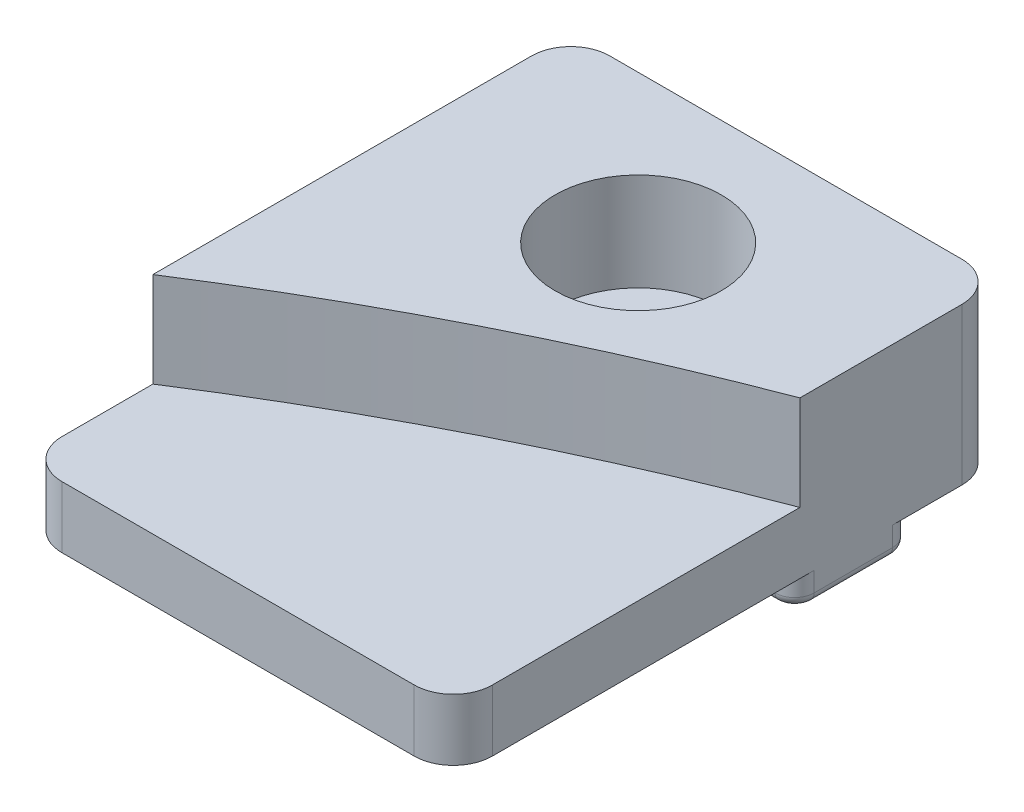
ISO-10303-21;
HEADER;
FILE_DESCRIPTION(('STEP AP214'),'2;1');
FILE_NAME('part.step','',(''),(''),'','','');
FILE_SCHEMA(('AUTOMOTIVE_DESIGN { 1 0 10303 214 1 1 1 1 }'));
ENDSEC;
DATA;
#1=APPLICATION_CONTEXT('core data for automotive mechanical design processes');
#2=APPLICATION_PROTOCOL_DEFINITION('international standard','automotive_design',2000,#1);
#3=PRODUCT_CONTEXT('',#1,'mechanical');
#4=PRODUCT('Part','Part','',(#3));
#5=PRODUCT_RELATED_PRODUCT_CATEGORY('part','',(#4));
#6=PRODUCT_DEFINITION_FORMATION('','',#4);
#7=PRODUCT_DEFINITION_CONTEXT('part definition',#1,'design');
#8=PRODUCT_DEFINITION('design','',#6,#7);
#9=PRODUCT_DEFINITION_SHAPE('','',#8);
#10=(LENGTH_UNIT() NAMED_UNIT(*) SI_UNIT(.MILLI.,.METRE.));
#11=(NAMED_UNIT(*) PLANE_ANGLE_UNIT() SI_UNIT($,.RADIAN.));
#12=(NAMED_UNIT(*) SI_UNIT($,.STERADIAN.) SOLID_ANGLE_UNIT());
#13=UNCERTAINTY_MEASURE_WITH_UNIT(LENGTH_MEASURE(1.E-05),#10,'distance_accuracy_value','');
#14=(GEOMETRIC_REPRESENTATION_CONTEXT(3) GLOBAL_UNCERTAINTY_ASSIGNED_CONTEXT((#13)) GLOBAL_UNIT_ASSIGNED_CONTEXT((#10,
#11,#12)) REPRESENTATION_CONTEXT('',''));
#15=CARTESIAN_POINT('',(0.,0.,0.));
#16=DIRECTION('',(0.,0.,1.));
#17=DIRECTION('',(1.,0.,0.));
#18=AXIS2_PLACEMENT_3D('',#15,#16,#17);
#19=CARTESIAN_POINT('',(-11.,-1.5,14.));
#20=DIRECTION('',(0.,0.,1.));
#21=DIRECTION('',(1.,0.,0.));
#22=AXIS2_PLACEMENT_3D('',#19,#20,#21);
#23=PLANE('',#22);
#24=DIRECTION('',(1.,0.,0.));
#25=VECTOR('',#24,1.);
#26=CARTESIAN_POINT('',(-11.,3.15,14.));
#27=LINE('',#26,#25);
#28=CARTESIAN_POINT('',(-9.,3.15,14.));
#29=VERTEX_POINT('',#28);
#30=CARTESIAN_POINT('',(9.,3.15,14.));
#31=VERTEX_POINT('',#30);
#32=EDGE_CURVE('E214',#29,#31,#27,.T.);
#33=ORIENTED_EDGE('',*,*,#32,.F.);
#34=DIRECTION('',(0.,1.,0.));
#35=VECTOR('',#34,1.);
#36=CARTESIAN_POINT('',(-9.,-1.5,14.));
#37=LINE('',#36,#35);
#38=CARTESIAN_POINT('',(-9.,0.,14.));
#39=VERTEX_POINT('',#38);
#40=EDGE_CURVE('E339',#29,#39,#37,.F.);
#41=ORIENTED_EDGE('',*,*,#40,.T.);
#42=DIRECTION('',(1.,0.,0.));
#43=VECTOR('',#42,1.);
#44=CARTESIAN_POINT('',(-11.,0.,14.));
#45=LINE('',#44,#43);
#46=CARTESIAN_POINT('',(9.,0.,14.));
#47=VERTEX_POINT('',#46);
#48=EDGE_CURVE('E230',#39,#47,#45,.T.);
#49=ORIENTED_EDGE('',*,*,#48,.T.);
#50=DIRECTION('',(0.,1.,0.));
#51=VECTOR('',#50,1.);
#52=CARTESIAN_POINT('',(9.,-1.5,14.));
#53=LINE('',#52,#51);
#54=EDGE_CURVE('E336',#47,#31,#53,.T.);
#55=ORIENTED_EDGE('',*,*,#54,.T.);
#56=EDGE_LOOP('',(#33,#41,#49,#55));
#57=FACE_BOUND('',#56,.T.);
#58=ADVANCED_FACE('F39',(#57),#23,.T.);
#59=CARTESIAN_POINT('',(-11.,-1.5,-14.));
#60=DIRECTION('',(-1.,0.,0.));
#61=DIRECTION('',(0.,0.,1.));
#62=AXIS2_PLACEMENT_3D('',#59,#60,#61);
#63=PLANE('',#62);
#64=DIRECTION('',(0.,0.,1.));
#65=VECTOR('',#64,1.);
#66=CARTESIAN_POINT('',(-11.,0.,-3.45));
#67=LINE('',#66,#65);
#68=CARTESIAN_POINT('',(-11.,0.,-4.45));
#69=VERTEX_POINT('',#68);
#70=CARTESIAN_POINT('',(-11.,0.,12.));
#71=VERTEX_POINT('',#70);
#72=EDGE_CURVE('E225',#69,#71,#67,.T.);
#73=ORIENTED_EDGE('',*,*,#72,.T.);
#74=DIRECTION('',(0.,1.,0.));
#75=VECTOR('',#74,1.);
#76=CARTESIAN_POINT('',(-11.,-1.5,12.));
#77=LINE('',#76,#75);
#78=CARTESIAN_POINT('',(-11.,3.15,12.));
#79=VERTEX_POINT('',#78);
#80=EDGE_CURVE('E213',#71,#79,#77,.T.);
#81=ORIENTED_EDGE('',*,*,#80,.T.);
#82=DIRECTION('',(0.,0.,1.));
#83=VECTOR('',#82,1.);
#84=CARTESIAN_POINT('',(-11.,3.15,7.35859212357451));
#85=LINE('',#84,#83);
#86=CARTESIAN_POINT('',(-11.,3.15,7.35859212357451));
#87=VERTEX_POINT('',#86);
#88=EDGE_CURVE('E206',#87,#79,#85,.T.);
#89=ORIENTED_EDGE('',*,*,#88,.F.);
#90=DIRECTION('',(0.,1.,0.));
#91=VECTOR('',#90,1.);
#92=CARTESIAN_POINT('',(-11.,3.15,7.35859212357451));
#93=LINE('',#92,#91);
#94=CARTESIAN_POINT('',(-11.,8.,7.35859212357451));
#95=VERTEX_POINT('',#94);
#96=EDGE_CURVE('E190',#87,#95,#93,.T.);
#97=ORIENTED_EDGE('',*,*,#96,.T.);
#98=DIRECTION('',(0.,0.,1.));
#99=VECTOR('',#98,1.);
#100=CARTESIAN_POINT('',(-11.,8.,-14.));
#101=LINE('',#100,#99);
#102=CARTESIAN_POINT('',(-11.,8.,-12.));
#103=VERTEX_POINT('',#102);
#104=EDGE_CURVE('E239',#103,#95,#101,.T.);
#105=ORIENTED_EDGE('',*,*,#104,.F.);
#106=DIRECTION('',(0.,1.,0.));
#107=VECTOR('',#106,1.);
#108=CARTESIAN_POINT('',(-11.,-1.5,-12.));
#109=LINE('',#108,#107);
#110=CARTESIAN_POINT('',(-11.,0.,-12.));
#111=VERTEX_POINT('',#110);
#112=EDGE_CURVE('E306',#103,#111,#109,.F.);
#113=ORIENTED_EDGE('',*,*,#112,.T.);
#114=DIRECTION('',(0.,0.,1.));
#115=VECTOR('',#114,1.);
#116=CARTESIAN_POINT('',(-11.,0.,-14.));
#117=LINE('',#116,#115);
#118=CARTESIAN_POINT('',(-11.,0.,-8.45));
#119=VERTEX_POINT('',#118);
#120=EDGE_CURVE('E372',#111,#119,#117,.T.);
#121=ORIENTED_EDGE('',*,*,#120,.T.);
#122=DIRECTION('',(0.,-1.,0.));
#123=VECTOR('',#122,1.);
#124=CARTESIAN_POINT('',(-11.,-1.5,-8.45));
#125=LINE('',#124,#123);
#126=CARTESIAN_POINT('',(-11.,-1.,-8.45));
#127=VERTEX_POINT('',#126);
#128=EDGE_CURVE('E252',#119,#127,#125,.T.);
#129=ORIENTED_EDGE('',*,*,#128,.T.);
#130=DIRECTION('',(0.,0.,1.));
#131=VECTOR('',#130,1.);
#132=CARTESIAN_POINT('',(-11.,-1.,-4.45));
#133=LINE('',#132,#131);
#134=CARTESIAN_POINT('',(-11.,-1.,-4.45));
#135=VERTEX_POINT('',#134);
#136=EDGE_CURVE('E302',#127,#135,#133,.T.);
#137=ORIENTED_EDGE('',*,*,#136,.T.);
#138=DIRECTION('',(0.,1.,0.));
#139=VECTOR('',#138,1.);
#140=CARTESIAN_POINT('',(-11.,0.,-4.45));
#141=LINE('',#140,#139);
#142=EDGE_CURVE('E255',#135,#69,#141,.T.);
#143=ORIENTED_EDGE('',*,*,#142,.T.);
#144=EDGE_LOOP('',(#73,#81,#89,#97,#105,#113,#121,#129,#137,#143));
#145=FACE_BOUND('',#144,.T.);
#146=ADVANCED_FACE('F211',(#145),#63,.T.);
#147=CARTESIAN_POINT('',(11.,-1.5,-14.));
#148=DIRECTION('',(0.,0.,-1.));
#149=DIRECTION('',(-1.,0.,0.));
#150=AXIS2_PLACEMENT_3D('',#147,#148,#149);
#151=PLANE('',#150);
#152=DIRECTION('',(1.,0.,0.));
#153=VECTOR('',#152,1.);
#154=CARTESIAN_POINT('',(-11.,0.,-14.));
#155=LINE('',#154,#153);
#156=CARTESIAN_POINT('',(-9.,0.,-14.));
#157=VERTEX_POINT('',#156);
#158=CARTESIAN_POINT('',(9.,0.,-14.));
#159=VERTEX_POINT('',#158);
#160=EDGE_CURVE('E363',#157,#159,#155,.T.);
#161=ORIENTED_EDGE('',*,*,#160,.F.);
#162=DIRECTION('',(0.,1.,0.));
#163=VECTOR('',#162,1.);
#164=CARTESIAN_POINT('',(-9.,-1.5,-14.));
#165=LINE('',#164,#163);
#166=CARTESIAN_POINT('',(-9.,8.,-14.));
#167=VERTEX_POINT('',#166);
#168=EDGE_CURVE('E352',#157,#167,#165,.T.);
#169=ORIENTED_EDGE('',*,*,#168,.T.);
#170=DIRECTION('',(-1.,0.,0.));
#171=VECTOR('',#170,1.);
#172=CARTESIAN_POINT('',(11.,8.,-14.));
#173=LINE('',#172,#171);
#174=CARTESIAN_POINT('',(9.,8.,-14.));
#175=VERTEX_POINT('',#174);
#176=EDGE_CURVE('E237',#175,#167,#173,.T.);
#177=ORIENTED_EDGE('',*,*,#176,.F.);
#178=DIRECTION('',(0.,1.,0.));
#179=VECTOR('',#178,1.);
#180=CARTESIAN_POINT('',(9.,-1.5,-14.));
#181=LINE('',#180,#179);
#182=EDGE_CURVE('E350',#175,#159,#181,.F.);
#183=ORIENTED_EDGE('',*,*,#182,.T.);
#184=EDGE_LOOP('',(#161,#169,#177,#183));
#185=FACE_BOUND('',#184,.T.);
#186=ADVANCED_FACE('F376',(#185),#151,.T.);
#187=CARTESIAN_POINT('',(11.,-1.5,14.));
#188=DIRECTION('',(1.,0.,0.));
#189=DIRECTION('',(0.,0.,-1.));
#190=AXIS2_PLACEMENT_3D('',#187,#188,#189);
#191=PLANE('',#190);
#192=DIRECTION('',(0.,0.,-1.));
#193=VECTOR('',#192,1.);
#194=CARTESIAN_POINT('',(11.,3.15,14.));
#195=LINE('',#194,#193);
#196=CARTESIAN_POINT('',(11.,3.15,12.));
#197=VERTEX_POINT('',#196);
#198=CARTESIAN_POINT('',(11.,3.15,-3.71881430774099));
#199=VERTEX_POINT('',#198);
#200=EDGE_CURVE('E201',#197,#199,#195,.T.);
#201=ORIENTED_EDGE('',*,*,#200,.F.);
#202=DIRECTION('',(0.,1.,0.));
#203=VECTOR('',#202,1.);
#204=CARTESIAN_POINT('',(11.,-1.5,12.));
#205=LINE('',#204,#203);
#206=CARTESIAN_POINT('',(11.,0.,12.));
#207=VERTEX_POINT('',#206);
#208=EDGE_CURVE('E348',#197,#207,#205,.F.);
#209=ORIENTED_EDGE('',*,*,#208,.T.);
#210=DIRECTION('',(0.,0.,1.));
#211=VECTOR('',#210,1.);
#212=CARTESIAN_POINT('',(11.,0.,-3.45));
#213=LINE('',#212,#211);
#214=CARTESIAN_POINT('',(11.,0.,-4.45));
#215=VERTEX_POINT('',#214);
#216=EDGE_CURVE('E223',#215,#207,#213,.T.);
#217=ORIENTED_EDGE('',*,*,#216,.F.);
#218=DIRECTION('',(0.,1.,0.));
#219=VECTOR('',#218,1.);
#220=CARTESIAN_POINT('',(11.,-1.5,-4.45));
#221=LINE('',#220,#219);
#222=CARTESIAN_POINT('',(11.,-1.,-4.45));
#223=VERTEX_POINT('',#222);
#224=EDGE_CURVE('E249',#215,#223,#221,.F.);
#225=ORIENTED_EDGE('',*,*,#224,.T.);
#226=DIRECTION('',(0.,0.,-1.));
#227=VECTOR('',#226,1.);
#228=CARTESIAN_POINT('',(11.,-1.,-8.45));
#229=LINE('',#228,#227);
#230=CARTESIAN_POINT('',(11.,-1.,-8.45));
#231=VERTEX_POINT('',#230);
#232=EDGE_CURVE('E292',#223,#231,#229,.T.);
#233=ORIENTED_EDGE('',*,*,#232,.T.);
#234=DIRECTION('',(0.,-1.,0.));
#235=VECTOR('',#234,1.);
#236=CARTESIAN_POINT('',(11.,0.,-8.45));
#237=LINE('',#236,#235);
#238=CARTESIAN_POINT('',(11.,0.,-8.45));
#239=VERTEX_POINT('',#238);
#240=EDGE_CURVE('E246',#231,#239,#237,.F.);
#241=ORIENTED_EDGE('',*,*,#240,.T.);
#242=DIRECTION('',(0.,0.,1.));
#243=VECTOR('',#242,1.);
#244=CARTESIAN_POINT('',(11.,0.,-14.));
#245=LINE('',#244,#243);
#246=CARTESIAN_POINT('',(11.,0.,-12.));
#247=VERTEX_POINT('',#246);
#248=EDGE_CURVE('E361',#247,#239,#245,.T.);
#249=ORIENTED_EDGE('',*,*,#248,.F.);
#250=DIRECTION('',(0.,1.,0.));
#251=VECTOR('',#250,1.);
#252=CARTESIAN_POINT('',(11.,-1.5,-12.));
#253=LINE('',#252,#251);
#254=CARTESIAN_POINT('',(11.,8.,-12.));
#255=VERTEX_POINT('',#254);
#256=EDGE_CURVE('E345',#247,#255,#253,.T.);
#257=ORIENTED_EDGE('',*,*,#256,.T.);
#258=DIRECTION('',(0.,0.,-1.));
#259=VECTOR('',#258,1.);
#260=CARTESIAN_POINT('',(11.,8.,14.));
#261=LINE('',#260,#259);
#262=CARTESIAN_POINT('',(11.,8.,-3.71881430774098));
#263=VERTEX_POINT('',#262);
#264=EDGE_CURVE('E233',#263,#255,#261,.T.);
#265=ORIENTED_EDGE('',*,*,#264,.F.);
#266=DIRECTION('',(0.,1.,0.));
#267=VECTOR('',#266,1.);
#268=CARTESIAN_POINT('',(11.,3.15,-3.71881430774099));
#269=LINE('',#268,#267);
#270=EDGE_CURVE('E200',#199,#263,#269,.T.);
#271=ORIENTED_EDGE('',*,*,#270,.F.);
#272=EDGE_LOOP('',(#201,#209,#217,#225,#233,#241,#249,#257,#265,#271));
#273=FACE_BOUND('',#272,.T.);
#274=ADVANCED_FACE('F368',(#273),#191,.T.);
#275=CARTESIAN_POINT('',(0.,-1.5,0.));
#276=DIRECTION('',(0.,1.,0.));
#277=DIRECTION('',(0.,0.,1.));
#278=AXIS2_PLACEMENT_3D('',#275,#276,#277);
#279=PLANE('',#278);
#280=DIRECTION('',(0.,0.,-1.));
#281=VECTOR('',#280,1.);
#282=CARTESIAN_POINT('',(10.5,-1.5,-4.45));
#283=LINE('',#282,#281);
#284=CARTESIAN_POINT('',(10.5,-1.5,-8.45));
#285=VERTEX_POINT('',#284);
#286=CARTESIAN_POINT('',(10.5,-1.5,-4.45));
#287=VERTEX_POINT('',#286);
#288=EDGE_CURVE('E284',#285,#287,#283,.F.);
#289=ORIENTED_EDGE('',*,*,#288,.T.);
#290=CARTESIAN_POINT('',(10.,-1.5,-4.45));
#291=DIRECTION('',(0.,1.,0.));
#292=DIRECTION('',(0.,0.,1.));
#293=AXIS2_PLACEMENT_3D('',#290,#291,#292);
#294=CIRCLE('',#293,0.5);
#295=CARTESIAN_POINT('',(10.,-1.5,-3.95));
#296=VERTEX_POINT('',#295);
#297=EDGE_CURVE('E286',#287,#296,#294,.F.);
#298=ORIENTED_EDGE('',*,*,#297,.T.);
#299=DIRECTION('',(1.,0.,0.));
#300=VECTOR('',#299,1.);
#301=CARTESIAN_POINT('',(0.,-1.5,-3.95));
#302=LINE('',#301,#300);
#303=CARTESIAN_POINT('',(-10.,-1.5,-3.95));
#304=VERTEX_POINT('',#303);
#305=EDGE_CURVE('E282',#296,#304,#302,.F.);
#306=ORIENTED_EDGE('',*,*,#305,.T.);
#307=CARTESIAN_POINT('',(-10.,-1.5,-4.45));
#308=DIRECTION('',(0.,1.,0.));
#309=DIRECTION('',(0.,0.,1.));
#310=AXIS2_PLACEMENT_3D('',#307,#308,#309);
#311=CIRCLE('',#310,0.5);
#312=CARTESIAN_POINT('',(-10.5,-1.5,-4.45));
#313=VERTEX_POINT('',#312);
#314=EDGE_CURVE('E278',#304,#313,#311,.F.);
#315=ORIENTED_EDGE('',*,*,#314,.T.);
#316=DIRECTION('',(0.,0.,1.));
#317=VECTOR('',#316,1.);
#318=CARTESIAN_POINT('',(-10.5,-1.5,-8.45));
#319=LINE('',#318,#317);
#320=CARTESIAN_POINT('',(-10.5,-1.5,-8.45));
#321=VERTEX_POINT('',#320);
#322=EDGE_CURVE('E274',#313,#321,#319,.F.);
#323=ORIENTED_EDGE('',*,*,#322,.T.);
#324=CARTESIAN_POINT('',(-10.,-1.5,-8.45));
#325=DIRECTION('',(0.,1.,0.));
#326=DIRECTION('',(0.,0.,1.));
#327=AXIS2_PLACEMENT_3D('',#324,#325,#326);
#328=CIRCLE('',#327,0.5);
#329=CARTESIAN_POINT('',(-10.,-1.5,-8.95));
#330=VERTEX_POINT('',#329);
#331=EDGE_CURVE('E272',#321,#330,#328,.F.);
#332=ORIENTED_EDGE('',*,*,#331,.T.);
#333=DIRECTION('',(1.,0.,0.));
#334=VECTOR('',#333,1.);
#335=CARTESIAN_POINT('',(0.,-1.5,-8.95));
#336=LINE('',#335,#334);
#337=CARTESIAN_POINT('',(10.,-1.5,-8.95));
#338=VERTEX_POINT('',#337);
#339=EDGE_CURVE('E276',#330,#338,#336,.T.);
#340=ORIENTED_EDGE('',*,*,#339,.T.);
#341=CARTESIAN_POINT('',(10.,-1.5,-8.45));
#342=DIRECTION('',(0.,1.,0.));
#343=DIRECTION('',(0.,0.,1.));
#344=AXIS2_PLACEMENT_3D('',#341,#342,#343);
#345=CIRCLE('',#344,0.5);
#346=EDGE_CURVE('E280',#338,#285,#345,.F.);
#347=ORIENTED_EDGE('',*,*,#346,.T.);
#348=EDGE_LOOP('',(#289,#298,#306,#315,#323,#332,#340,#347));
#349=FACE_BOUND('',#348,.T.);
#350=CARTESIAN_POINT('',(0.,-1.49999999999999,-6.45));
#351=DIRECTION('',(0.,1.,0.));
#352=DIRECTION('',(0.,0.,1.));
#353=AXIS2_PLACEMENT_3D('',#350,#351,#352);
#354=CIRCLE('',#353,2.15000000000001);
#355=CARTESIAN_POINT('',(0.,-1.49999999999999,-4.29999999999999));
#356=VERTEX_POINT('',#355);
#357=EDGE_CURVE('E373',#356,#356,#354,.T.);
#358=ORIENTED_EDGE('',*,*,#357,.T.);
#359=EDGE_LOOP('',(#358));
#360=FACE_BOUND('',#359,.T.);
#361=ADVANCED_FACE('F408',(#349,#360),#279,.F.);
#362=CARTESIAN_POINT('',(0.,8.,0.));
#363=DIRECTION('',(0.,1.,0.));
#364=DIRECTION('',(0.,0.,1.));
#365=AXIS2_PLACEMENT_3D('',#362,#363,#364);
#366=PLANE('',#365);
#367=CARTESIAN_POINT('',(0.,8.,-6.45));
#368=DIRECTION('',(0.,1.,0.));
#369=DIRECTION('',(0.,0.,1.));
#370=AXIS2_PLACEMENT_3D('',#367,#368,#369);
#371=CIRCLE('',#370,4.24999999999999);
#372=CARTESIAN_POINT('',(0.,8.,-2.20000000000001));
#373=VERTEX_POINT('',#372);
#374=EDGE_CURVE('E329',#373,#373,#371,.T.);
#375=ORIENTED_EDGE('',*,*,#374,.F.);
#376=EDGE_LOOP('',(#375));
#377=FACE_BOUND('',#376,.T.);
#378=ORIENTED_EDGE('',*,*,#176,.T.);
#379=CARTESIAN_POINT('',(-9.,8.,-12.));
#380=DIRECTION('',(0.,1.,0.));
#381=DIRECTION('',(0.,0.,1.));
#382=AXIS2_PLACEMENT_3D('',#379,#380,#381);
#383=CIRCLE('',#382,2.);
#384=EDGE_CURVE('E54',#167,#103,#383,.T.);
#385=ORIENTED_EDGE('',*,*,#384,.T.);
#386=ORIENTED_EDGE('',*,*,#104,.T.);
#387=CARTESIAN_POINT('',(53.23,8.,107.535970308474));
#388=DIRECTION('',(0.,1.,0.));
#389=DIRECTION('',(0.,0.,1.));
#390=AXIS2_PLACEMENT_3D('',#387,#388,#389);
#391=CIRCLE('',#390,119.000000000002);
#392=EDGE_CURVE('E196',#263,#95,#391,.T.);
#393=ORIENTED_EDGE('',*,*,#392,.F.);
#394=ORIENTED_EDGE('',*,*,#264,.T.);
#395=CARTESIAN_POINT('',(9.,8.,-12.));
#396=DIRECTION('',(0.,1.,0.));
#397=DIRECTION('',(0.,0.,1.));
#398=AXIS2_PLACEMENT_3D('',#395,#396,#397);
#399=CIRCLE('',#398,2.);
#400=EDGE_CURVE('E62',#255,#175,#399,.T.);
#401=ORIENTED_EDGE('',*,*,#400,.T.);
#402=EDGE_LOOP('',(#378,#385,#386,#393,#394,#401));
#403=FACE_BOUND('',#402,.T.);
#404=ADVANCED_FACE('F377',(#377,#403),#366,.T.);
#405=CARTESIAN_POINT('',(-11.,0.,-3.45));
#406=DIRECTION('',(0.,1.,0.));
#407=DIRECTION('',(0.,0.,1.));
#408=AXIS2_PLACEMENT_3D('',#405,#406,#407);
#409=PLANE('',#408);
#410=ORIENTED_EDGE('',*,*,#48,.F.);
#411=CARTESIAN_POINT('',(-9.,0.,12.));
#412=DIRECTION('',(0.,1.,0.));
#413=DIRECTION('',(0.,0.,1.));
#414=AXIS2_PLACEMENT_3D('',#411,#412,#413);
#415=CIRCLE('',#414,2.);
#416=EDGE_CURVE('E343',#39,#71,#415,.F.);
#417=ORIENTED_EDGE('',*,*,#416,.T.);
#418=ORIENTED_EDGE('',*,*,#72,.F.);
#419=CARTESIAN_POINT('',(-10.,0.,-4.45));
#420=DIRECTION('',(0.,1.,0.));
#421=DIRECTION('',(0.,0.,1.));
#422=AXIS2_PLACEMENT_3D('',#419,#420,#421);
#423=CIRCLE('',#422,1.);
#424=CARTESIAN_POINT('',(-10.,0.,-3.45));
#425=VERTEX_POINT('',#424);
#426=EDGE_CURVE('E265',#69,#425,#423,.T.);
#427=ORIENTED_EDGE('',*,*,#426,.T.);
#428=DIRECTION('',(1.,0.,0.));
#429=VECTOR('',#428,1.);
#430=CARTESIAN_POINT('',(-11.,0.,-3.45));
#431=LINE('',#430,#429);
#432=CARTESIAN_POINT('',(10.,0.,-3.45));
#433=VERTEX_POINT('',#432);
#434=EDGE_CURVE('E227',#425,#433,#431,.T.);
#435=ORIENTED_EDGE('',*,*,#434,.T.);
#436=CARTESIAN_POINT('',(10.,0.,-4.45));
#437=DIRECTION('',(0.,1.,0.));
#438=DIRECTION('',(0.,0.,1.));
#439=AXIS2_PLACEMENT_3D('',#436,#437,#438);
#440=CIRCLE('',#439,1.);
#441=EDGE_CURVE('E262',#433,#215,#440,.T.);
#442=ORIENTED_EDGE('',*,*,#441,.T.);
#443=ORIENTED_EDGE('',*,*,#216,.T.);
#444=CARTESIAN_POINT('',(9.,0.,12.));
#445=DIRECTION('',(0.,1.,0.));
#446=DIRECTION('',(0.,0.,1.));
#447=AXIS2_PLACEMENT_3D('',#444,#445,#446);
#448=CIRCLE('',#447,2.);
#449=EDGE_CURVE('E341',#207,#47,#448,.F.);
#450=ORIENTED_EDGE('',*,*,#449,.T.);
#451=EDGE_LOOP('',(#410,#417,#418,#427,#435,#442,#443,#450));
#452=FACE_BOUND('',#451,.T.);
#453=ADVANCED_FACE('F436',(#452),#409,.F.);
#454=CARTESIAN_POINT('',(-11.,-1.5,-3.45));
#455=DIRECTION('',(0.,0.,-1.));
#456=DIRECTION('',(0.,1.,0.));
#457=AXIS2_PLACEMENT_3D('',#454,#455,#456);
#458=PLANE('',#457);
#459=DIRECTION('',(0.,1.,0.));
#460=VECTOR('',#459,1.);
#461=CARTESIAN_POINT('',(-10.,-1.5,-3.45));
#462=LINE('',#461,#460);
#463=CARTESIAN_POINT('',(-10.,-1.,-3.45));
#464=VERTEX_POINT('',#463);
#465=EDGE_CURVE('E241',#425,#464,#462,.F.);
#466=ORIENTED_EDGE('',*,*,#465,.T.);
#467=DIRECTION('',(1.,0.,0.));
#468=VECTOR('',#467,1.);
#469=CARTESIAN_POINT('',(-11.,-1.,-3.45));
#470=LINE('',#469,#468);
#471=CARTESIAN_POINT('',(10.,-1.,-3.45));
#472=VERTEX_POINT('',#471);
#473=EDGE_CURVE('E294',#464,#472,#470,.T.);
#474=ORIENTED_EDGE('',*,*,#473,.T.);
#475=DIRECTION('',(0.,1.,0.));
#476=VECTOR('',#475,1.);
#477=CARTESIAN_POINT('',(10.,0.,-3.45));
#478=LINE('',#477,#476);
#479=EDGE_CURVE('E244',#472,#433,#478,.T.);
#480=ORIENTED_EDGE('',*,*,#479,.T.);
#481=ORIENTED_EDGE('',*,*,#434,.F.);
#482=EDGE_LOOP('',(#466,#474,#480,#481));
#483=FACE_BOUND('',#482,.T.);
#484=ADVANCED_FACE('F438',(#483),#458,.F.);
#485=CARTESIAN_POINT('',(53.23,3.15,107.535970308474));
#486=DIRECTION('',(0.,1.,0.));
#487=DIRECTION('',(0.,0.,1.));
#488=AXIS2_PLACEMENT_3D('',#485,#486,#487);
#489=CYLINDRICAL_SURFACE('',#488,119.000000000002);
#490=ORIENTED_EDGE('',*,*,#392,.T.);
#491=ORIENTED_EDGE('',*,*,#96,.F.);
#492=CARTESIAN_POINT('',(53.23,3.15,107.535970308474));
#493=DIRECTION('',(0.,1.,0.));
#494=DIRECTION('',(0.,0.,1.));
#495=AXIS2_PLACEMENT_3D('',#492,#493,#494);
#496=CIRCLE('',#495,119.000000000002);
#497=EDGE_CURVE('E193',#199,#87,#496,.T.);
#498=ORIENTED_EDGE('',*,*,#497,.F.);
#499=ORIENTED_EDGE('',*,*,#270,.T.);
#500=EDGE_LOOP('',(#490,#491,#498,#499));
#501=FACE_BOUND('',#500,.T.);
#502=ADVANCED_FACE('F192',(#501),#489,.F.);
#503=CARTESIAN_POINT('',(53.23,3.15,107.535970308474));
#504=DIRECTION('',(0.,1.,0.));
#505=DIRECTION('',(0.,0.,1.));
#506=AXIS2_PLACEMENT_3D('',#503,#504,#505);
#507=PLANE('',#506);
#508=ORIENTED_EDGE('',*,*,#88,.T.);
#509=CARTESIAN_POINT('',(-9.,3.15,12.));
#510=DIRECTION('',(0.,1.,0.));
#511=DIRECTION('',(0.,0.,1.));
#512=AXIS2_PLACEMENT_3D('',#509,#510,#511);
#513=CIRCLE('',#512,2.);
#514=EDGE_CURVE('E334',#79,#29,#513,.T.);
#515=ORIENTED_EDGE('',*,*,#514,.T.);
#516=ORIENTED_EDGE('',*,*,#32,.T.);
#517=CARTESIAN_POINT('',(9.,3.15,12.));
#518=DIRECTION('',(0.,1.,0.));
#519=DIRECTION('',(0.,0.,1.));
#520=AXIS2_PLACEMENT_3D('',#517,#518,#519);
#521=CIRCLE('',#520,2.);
#522=EDGE_CURVE('E332',#31,#197,#521,.T.);
#523=ORIENTED_EDGE('',*,*,#522,.T.);
#524=ORIENTED_EDGE('',*,*,#200,.T.);
#525=ORIENTED_EDGE('',*,*,#497,.T.);
#526=EDGE_LOOP('',(#508,#515,#516,#523,#524,#525));
#527=FACE_BOUND('',#526,.T.);
#528=ADVANCED_FACE('F205',(#527),#507,.T.);
#529=CARTESIAN_POINT('',(-11.,0.,-9.45));
#530=DIRECTION('',(0.,0.,1.));
#531=DIRECTION('',(1.,0.,0.));
#532=AXIS2_PLACEMENT_3D('',#529,#530,#531);
#533=PLANE('',#532);
#534=DIRECTION('',(0.,-1.,0.));
#535=VECTOR('',#534,1.);
#536=CARTESIAN_POINT('',(10.,-1.5,-9.45));
#537=LINE('',#536,#535);
#538=CARTESIAN_POINT('',(10.,0.,-9.45));
#539=VERTEX_POINT('',#538);
#540=CARTESIAN_POINT('',(10.,-1.,-9.45));
#541=VERTEX_POINT('',#540);
#542=EDGE_CURVE('E259',#539,#541,#537,.T.);
#543=ORIENTED_EDGE('',*,*,#542,.T.);
#544=DIRECTION('',(1.,0.,0.));
#545=VECTOR('',#544,1.);
#546=CARTESIAN_POINT('',(-11.,-1.,-9.45));
#547=LINE('',#546,#545);
#548=CARTESIAN_POINT('',(-10.,-1.,-9.45));
#549=VERTEX_POINT('',#548);
#550=EDGE_CURVE('E300',#541,#549,#547,.F.);
#551=ORIENTED_EDGE('',*,*,#550,.T.);
#552=DIRECTION('',(0.,-1.,0.));
#553=VECTOR('',#552,1.);
#554=CARTESIAN_POINT('',(-10.,0.,-9.45));
#555=LINE('',#554,#553);
#556=CARTESIAN_POINT('',(-10.,0.,-9.45));
#557=VERTEX_POINT('',#556);
#558=EDGE_CURVE('E257',#549,#557,#555,.F.);
#559=ORIENTED_EDGE('',*,*,#558,.T.);
#560=DIRECTION('',(1.,0.,0.));
#561=VECTOR('',#560,1.);
#562=CARTESIAN_POINT('',(-11.,0.,-9.45));
#563=LINE('',#562,#561);
#564=EDGE_CURVE('E222',#557,#539,#563,.T.);
#565=ORIENTED_EDGE('',*,*,#564,.T.);
#566=EDGE_LOOP('',(#543,#551,#559,#565));
#567=FACE_BOUND('',#566,.T.);
#568=ADVANCED_FACE('F390',(#567),#533,.F.);
#569=CARTESIAN_POINT('',(-11.,0.,-14.));
#570=DIRECTION('',(0.,1.,0.));
#571=DIRECTION('',(0.,0.,1.));
#572=AXIS2_PLACEMENT_3D('',#569,#570,#571);
#573=PLANE('',#572);
#574=ORIENTED_EDGE('',*,*,#120,.F.);
#575=CARTESIAN_POINT('',(-9.,0.,-12.));
#576=DIRECTION('',(0.,1.,0.));
#577=DIRECTION('',(0.,0.,1.));
#578=AXIS2_PLACEMENT_3D('',#575,#576,#577);
#579=CIRCLE('',#578,2.);
#580=EDGE_CURVE('E11',#111,#157,#579,.F.);
#581=ORIENTED_EDGE('',*,*,#580,.T.);
#582=ORIENTED_EDGE('',*,*,#160,.T.);
#583=CARTESIAN_POINT('',(9.,0.,-12.));
#584=DIRECTION('',(0.,1.,0.));
#585=DIRECTION('',(0.,0.,1.));
#586=AXIS2_PLACEMENT_3D('',#583,#584,#585);
#587=CIRCLE('',#586,2.);
#588=EDGE_CURVE('E47',#159,#247,#587,.F.);
#589=ORIENTED_EDGE('',*,*,#588,.T.);
#590=ORIENTED_EDGE('',*,*,#248,.T.);
#591=CARTESIAN_POINT('',(10.,0.,-8.45));
#592=DIRECTION('',(0.,1.,0.));
#593=DIRECTION('',(0.,0.,1.));
#594=AXIS2_PLACEMENT_3D('',#591,#592,#593);
#595=CIRCLE('',#594,1.);
#596=EDGE_CURVE('E267',#239,#539,#595,.T.);
#597=ORIENTED_EDGE('',*,*,#596,.T.);
#598=ORIENTED_EDGE('',*,*,#564,.F.);
#599=CARTESIAN_POINT('',(-10.,0.,-8.45));
#600=DIRECTION('',(0.,1.,0.));
#601=DIRECTION('',(0.,0.,1.));
#602=AXIS2_PLACEMENT_3D('',#599,#600,#601);
#603=CIRCLE('',#602,1.);
#604=EDGE_CURVE('E269',#557,#119,#603,.T.);
#605=ORIENTED_EDGE('',*,*,#604,.T.);
#606=EDGE_LOOP('',(#574,#581,#582,#589,#590,#597,#598,#605));
#607=FACE_BOUND('',#606,.T.);
#608=ADVANCED_FACE('F360',(#607),#573,.F.);
#609=CARTESIAN_POINT('',(0.,8.,-6.45));
#610=DIRECTION('',(0.,1.,0.));
#611=DIRECTION('',(0.,0.,1.));
#612=AXIS2_PLACEMENT_3D('',#609,#610,#611);
#613=CYLINDRICAL_SURFACE('',#612,2.15000000000001);
#614=ORIENTED_EDGE('',*,*,#357,.F.);
#615=EDGE_LOOP('',(#614));
#616=FACE_BOUND('',#615,.T.);
#617=CARTESIAN_POINT('',(0.,3.,-6.45));
#618=DIRECTION('',(0.,1.,0.));
#619=DIRECTION('',(0.,0.,1.));
#620=AXIS2_PLACEMENT_3D('',#617,#618,#619);
#621=CIRCLE('',#620,2.15000000000001);
#622=CARTESIAN_POINT('',(0.,3.,-4.29999999999999));
#623=VERTEX_POINT('',#622);
#624=EDGE_CURVE('E732',#623,#623,#621,.T.);
#625=ORIENTED_EDGE('',*,*,#624,.T.);
#626=EDGE_LOOP('',(#625));
#627=FACE_BOUND('',#626,.T.);
#628=ADVANCED_FACE('F602',(#616,#627),#613,.F.);
#629=CARTESIAN_POINT('',(2.15000000000001,3.,-6.45));
#630=DIRECTION('',(0.,-1.,0.));
#631=DIRECTION('',(0.,0.,-1.));
#632=AXIS2_PLACEMENT_3D('',#629,#630,#631);
#633=PLANE('',#632);
#634=ORIENTED_EDGE('',*,*,#624,.F.);
#635=EDGE_LOOP('',(#634));
#636=FACE_BOUND('',#635,.T.);
#637=CARTESIAN_POINT('',(0.,3.,-6.45));
#638=DIRECTION('',(0.,1.,0.));
#639=DIRECTION('',(0.,0.,1.));
#640=AXIS2_PLACEMENT_3D('',#637,#638,#639);
#641=CIRCLE('',#640,4.24999999999999);
#642=CARTESIAN_POINT('',(0.,3.,-2.20000000000001));
#643=VERTEX_POINT('',#642);
#644=EDGE_CURVE('E728',#643,#643,#641,.T.);
#645=ORIENTED_EDGE('',*,*,#644,.T.);
#646=EDGE_LOOP('',(#645));
#647=FACE_BOUND('',#646,.T.);
#648=ADVANCED_FACE('F637',(#636,#647),#633,.F.);
#649=CARTESIAN_POINT('',(0.,8.,-6.45));
#650=DIRECTION('',(0.,1.,0.));
#651=DIRECTION('',(0.,0.,1.));
#652=AXIS2_PLACEMENT_3D('',#649,#650,#651);
#653=CYLINDRICAL_SURFACE('',#652,4.24999999999999);
#654=ORIENTED_EDGE('',*,*,#644,.F.);
#655=EDGE_LOOP('',(#654));
#656=FACE_BOUND('',#655,.T.);
#657=ORIENTED_EDGE('',*,*,#374,.T.);
#658=EDGE_LOOP('',(#657));
#659=FACE_BOUND('',#658,.T.);
#660=ADVANCED_FACE('F481',(#656,#659),#653,.F.);
#661=CARTESIAN_POINT('',(10.,-1.5,-4.45));
#662=DIRECTION('',(0.,-1.,0.));
#663=DIRECTION('',(0.,0.,-1.));
#664=AXIS2_PLACEMENT_3D('',#661,#662,#663);
#665=CYLINDRICAL_SURFACE('',#664,1.);
#666=ORIENTED_EDGE('',*,*,#479,.F.);
#667=CARTESIAN_POINT('',(10.,-1.,-4.45));
#668=DIRECTION('',(0.,1.,0.));
#669=DIRECTION('',(0.,0.,1.));
#670=AXIS2_PLACEMENT_3D('',#667,#668,#669);
#671=CIRCLE('',#670,1.);
#672=EDGE_CURVE('E289',#472,#223,#671,.T.);
#673=ORIENTED_EDGE('',*,*,#672,.T.);
#674=ORIENTED_EDGE('',*,*,#224,.F.);
#675=ORIENTED_EDGE('',*,*,#441,.F.);
#676=EDGE_LOOP('',(#666,#673,#674,#675));
#677=FACE_BOUND('',#676,.T.);
#678=ADVANCED_FACE('F446',(#677),#665,.T.);
#679=CARTESIAN_POINT('',(-10.,-1.5,-4.45));
#680=DIRECTION('',(0.,-1.,0.));
#681=DIRECTION('',(0.,0.,-1.));
#682=AXIS2_PLACEMENT_3D('',#679,#680,#681);
#683=CYLINDRICAL_SURFACE('',#682,1.);
#684=ORIENTED_EDGE('',*,*,#142,.F.);
#685=CARTESIAN_POINT('',(-10.,-1.,-4.45));
#686=DIRECTION('',(0.,1.,0.));
#687=DIRECTION('',(0.,0.,1.));
#688=AXIS2_PLACEMENT_3D('',#685,#686,#687);
#689=CIRCLE('',#688,1.);
#690=EDGE_CURVE('E298',#135,#464,#689,.T.);
#691=ORIENTED_EDGE('',*,*,#690,.T.);
#692=ORIENTED_EDGE('',*,*,#465,.F.);
#693=ORIENTED_EDGE('',*,*,#426,.F.);
#694=EDGE_LOOP('',(#684,#691,#692,#693));
#695=FACE_BOUND('',#694,.T.);
#696=ADVANCED_FACE('F431',(#695),#683,.T.);
#697=CARTESIAN_POINT('',(10.,0.,-8.45));
#698=DIRECTION('',(0.,1.,0.));
#699=DIRECTION('',(0.,0.,1.));
#700=AXIS2_PLACEMENT_3D('',#697,#698,#699);
#701=CYLINDRICAL_SURFACE('',#700,1.);
#702=ORIENTED_EDGE('',*,*,#240,.F.);
#703=CARTESIAN_POINT('',(10.,-1.,-8.45));
#704=DIRECTION('',(0.,1.,0.));
#705=DIRECTION('',(0.,0.,1.));
#706=AXIS2_PLACEMENT_3D('',#703,#704,#705);
#707=CIRCLE('',#706,1.);
#708=EDGE_CURVE('E296',#231,#541,#707,.T.);
#709=ORIENTED_EDGE('',*,*,#708,.T.);
#710=ORIENTED_EDGE('',*,*,#542,.F.);
#711=ORIENTED_EDGE('',*,*,#596,.F.);
#712=EDGE_LOOP('',(#702,#709,#710,#711));
#713=FACE_BOUND('',#712,.T.);
#714=ADVANCED_FACE('F394',(#713),#701,.T.);
#715=CARTESIAN_POINT('',(-10.,-1.5,-8.45));
#716=DIRECTION('',(0.,1.,0.));
#717=DIRECTION('',(0.,0.,1.));
#718=AXIS2_PLACEMENT_3D('',#715,#716,#717);
#719=CYLINDRICAL_SURFACE('',#718,1.);
#720=ORIENTED_EDGE('',*,*,#558,.F.);
#721=CARTESIAN_POINT('',(-10.,-1.,-8.45));
#722=DIRECTION('',(0.,1.,0.));
#723=DIRECTION('',(0.,0.,1.));
#724=AXIS2_PLACEMENT_3D('',#721,#722,#723);
#725=CIRCLE('',#724,1.);
#726=EDGE_CURVE('E304',#549,#127,#725,.T.);
#727=ORIENTED_EDGE('',*,*,#726,.T.);
#728=ORIENTED_EDGE('',*,*,#128,.F.);
#729=ORIENTED_EDGE('',*,*,#604,.F.);
#730=EDGE_LOOP('',(#720,#727,#728,#729));
#731=FACE_BOUND('',#730,.T.);
#732=ADVANCED_FACE('F417',(#731),#719,.T.);
#733=CARTESIAN_POINT('',(-10.,-1.,-8.45));
#734=DIRECTION('',(0.,1.,0.));
#735=DIRECTION('',(0.,0.,1.));
#736=AXIS2_PLACEMENT_3D('',#733,#734,#735);
#737=DEGENERATE_TOROIDAL_SURFACE('',#736,0.5,0.5,.T.);
#738=CARTESIAN_POINT('',(-10.5,-1.,-8.45));
#739=DIRECTION('',(0.,0.,1.));
#740=DIRECTION('',(1.,0.,0.));
#741=AXIS2_PLACEMENT_3D('',#738,#739,#740);
#742=CIRCLE('',#741,0.5);
#743=EDGE_CURVE('E323',#127,#321,#742,.T.);
#744=ORIENTED_EDGE('',*,*,#743,.F.);
#745=ORIENTED_EDGE('',*,*,#726,.F.);
#746=CARTESIAN_POINT('',(-10.,-1.,-8.95));
#747=DIRECTION('',(1.,0.,0.));
#748=DIRECTION('',(0.,0.,-1.));
#749=AXIS2_PLACEMENT_3D('',#746,#747,#748);
#750=CIRCLE('',#749,0.5);
#751=EDGE_CURVE('E326',#330,#549,#750,.T.);
#752=ORIENTED_EDGE('',*,*,#751,.F.);
#753=ORIENTED_EDGE('',*,*,#331,.F.);
#754=EDGE_LOOP('',(#744,#745,#752,#753));
#755=FACE_BOUND('',#754,.T.);
#756=ADVANCED_FACE('F420',(#755),#737,.T.);
#757=CARTESIAN_POINT('',(0.,-1.,-8.95));
#758=DIRECTION('',(1.,0.,0.));
#759=DIRECTION('',(0.,0.,-1.));
#760=AXIS2_PLACEMENT_3D('',#757,#758,#759);
#761=CYLINDRICAL_SURFACE('',#760,0.5);
#762=ORIENTED_EDGE('',*,*,#751,.T.);
#763=ORIENTED_EDGE('',*,*,#550,.F.);
#764=CARTESIAN_POINT('',(10.,-1.,-8.95));
#765=DIRECTION('',(1.,0.,0.));
#766=DIRECTION('',(0.,0.,-1.));
#767=AXIS2_PLACEMENT_3D('',#764,#765,#766);
#768=CIRCLE('',#767,0.5);
#769=EDGE_CURVE('E320',#338,#541,#768,.T.);
#770=ORIENTED_EDGE('',*,*,#769,.F.);
#771=ORIENTED_EDGE('',*,*,#339,.F.);
#772=EDGE_LOOP('',(#762,#763,#770,#771));
#773=FACE_BOUND('',#772,.T.);
#774=ADVANCED_FACE('F414',(#773),#761,.T.);
#775=CARTESIAN_POINT('',(-10.5,-1.,-14.));
#776=DIRECTION('',(0.,0.,-1.));
#777=DIRECTION('',(-1.,0.,0.));
#778=AXIS2_PLACEMENT_3D('',#775,#776,#777);
#779=CYLINDRICAL_SURFACE('',#778,0.5);
#780=ORIENTED_EDGE('',*,*,#743,.T.);
#781=ORIENTED_EDGE('',*,*,#322,.F.);
#782=CARTESIAN_POINT('',(-10.5,-1.,-4.45));
#783=DIRECTION('',(0.,0.,1.));
#784=DIRECTION('',(1.,0.,0.));
#785=AXIS2_PLACEMENT_3D('',#782,#783,#784);
#786=CIRCLE('',#785,0.5);
#787=EDGE_CURVE('E317',#135,#313,#786,.T.);
#788=ORIENTED_EDGE('',*,*,#787,.F.);
#789=ORIENTED_EDGE('',*,*,#136,.F.);
#790=EDGE_LOOP('',(#780,#781,#788,#789));
#791=FACE_BOUND('',#790,.T.);
#792=ADVANCED_FACE('F425',(#791),#779,.T.);
#793=CARTESIAN_POINT('',(10.,-1.,-8.45));
#794=DIRECTION('',(0.,1.,0.));
#795=DIRECTION('',(0.,0.,1.));
#796=AXIS2_PLACEMENT_3D('',#793,#794,#795);
#797=DEGENERATE_TOROIDAL_SURFACE('',#796,0.5,0.5,.T.);
#798=ORIENTED_EDGE('',*,*,#769,.T.);
#799=ORIENTED_EDGE('',*,*,#708,.F.);
#800=CARTESIAN_POINT('',(10.5,-1.,-8.45));
#801=DIRECTION('',(0.,0.,1.));
#802=DIRECTION('',(1.,0.,0.));
#803=AXIS2_PLACEMENT_3D('',#800,#801,#802);
#804=CIRCLE('',#803,0.5);
#805=EDGE_CURVE('E314',#285,#231,#804,.T.);
#806=ORIENTED_EDGE('',*,*,#805,.F.);
#807=ORIENTED_EDGE('',*,*,#346,.F.);
#808=EDGE_LOOP('',(#798,#799,#806,#807));
#809=FACE_BOUND('',#808,.T.);
#810=ADVANCED_FACE('F398',(#809),#797,.T.);
#811=CARTESIAN_POINT('',(-10.,-1.,-4.45));
#812=DIRECTION('',(0.,1.,0.));
#813=DIRECTION('',(0.,0.,1.));
#814=AXIS2_PLACEMENT_3D('',#811,#812,#813);
#815=DEGENERATE_TOROIDAL_SURFACE('',#814,0.5,0.5,.T.);
#816=ORIENTED_EDGE('',*,*,#787,.T.);
#817=ORIENTED_EDGE('',*,*,#314,.F.);
#818=CARTESIAN_POINT('',(-10.,-0.999999999999999,-3.95));
#819=DIRECTION('',(1.,0.,0.));
#820=DIRECTION('',(0.,0.,-1.));
#821=AXIS2_PLACEMENT_3D('',#818,#819,#820);
#822=CIRCLE('',#821,0.5);
#823=EDGE_CURVE('E311',#464,#304,#822,.T.);
#824=ORIENTED_EDGE('',*,*,#823,.F.);
#825=ORIENTED_EDGE('',*,*,#690,.F.);
#826=EDGE_LOOP('',(#816,#817,#824,#825));
#827=FACE_BOUND('',#826,.T.);
#828=ADVANCED_FACE('F493',(#827),#815,.T.);
#829=CARTESIAN_POINT('',(10.5,-1.,14.));
#830=DIRECTION('',(0.,0.,1.));
#831=DIRECTION('',(1.,0.,0.));
#832=AXIS2_PLACEMENT_3D('',#829,#830,#831);
#833=CYLINDRICAL_SURFACE('',#832,0.5);
#834=ORIENTED_EDGE('',*,*,#805,.T.);
#835=ORIENTED_EDGE('',*,*,#232,.F.);
#836=CARTESIAN_POINT('',(10.5,-1.,-4.45));
#837=DIRECTION('',(0.,0.,1.));
#838=DIRECTION('',(1.,0.,0.));
#839=AXIS2_PLACEMENT_3D('',#836,#837,#838);
#840=CIRCLE('',#839,0.5);
#841=EDGE_CURVE('E309',#287,#223,#840,.T.);
#842=ORIENTED_EDGE('',*,*,#841,.F.);
#843=ORIENTED_EDGE('',*,*,#288,.F.);
#844=EDGE_LOOP('',(#834,#835,#842,#843));
#845=FACE_BOUND('',#844,.T.);
#846=ADVANCED_FACE('F404',(#845),#833,.T.);
#847=CARTESIAN_POINT('',(-11.,-1.,-3.95));
#848=DIRECTION('',(1.,0.,0.));
#849=DIRECTION('',(0.,0.,-1.));
#850=AXIS2_PLACEMENT_3D('',#847,#848,#849);
#851=CYLINDRICAL_SURFACE('',#850,0.5);
#852=ORIENTED_EDGE('',*,*,#823,.T.);
#853=ORIENTED_EDGE('',*,*,#305,.F.);
#854=CARTESIAN_POINT('',(10.,-1.,-3.95));
#855=DIRECTION('',(1.,0.,0.));
#856=DIRECTION('',(0.,0.,-1.));
#857=AXIS2_PLACEMENT_3D('',#854,#855,#856);
#858=CIRCLE('',#857,0.5);
#859=EDGE_CURVE('E307',#472,#296,#858,.T.);
#860=ORIENTED_EDGE('',*,*,#859,.F.);
#861=ORIENTED_EDGE('',*,*,#473,.F.);
#862=EDGE_LOOP('',(#852,#853,#860,#861));
#863=FACE_BOUND('',#862,.T.);
#864=ADVANCED_FACE('F466',(#863),#851,.T.);
#865=CARTESIAN_POINT('',(10.,-1.,-4.45));
#866=DIRECTION('',(0.,1.,0.));
#867=DIRECTION('',(0.,0.,1.));
#868=AXIS2_PLACEMENT_3D('',#865,#866,#867);
#869=DEGENERATE_TOROIDAL_SURFACE('',#868,0.5,0.5,.T.);
#870=ORIENTED_EDGE('',*,*,#841,.T.);
#871=ORIENTED_EDGE('',*,*,#672,.F.);
#872=ORIENTED_EDGE('',*,*,#859,.T.);
#873=ORIENTED_EDGE('',*,*,#297,.F.);
#874=EDGE_LOOP('',(#870,#871,#872,#873));
#875=FACE_BOUND('',#874,.T.);
#876=ADVANCED_FACE('F459',(#875),#869,.T.);
#877=CARTESIAN_POINT('',(-9.,-1.5,12.));
#878=DIRECTION('',(0.,1.,0.));
#879=DIRECTION('',(0.,0.,1.));
#880=AXIS2_PLACEMENT_3D('',#877,#878,#879);
#881=CYLINDRICAL_SURFACE('',#880,2.);
#882=ORIENTED_EDGE('',*,*,#416,.F.);
#883=ORIENTED_EDGE('',*,*,#40,.F.);
#884=ORIENTED_EDGE('',*,*,#514,.F.);
#885=ORIENTED_EDGE('',*,*,#80,.F.);
#886=EDGE_LOOP('',(#882,#883,#884,#885));
#887=FACE_BOUND('',#886,.T.);
#888=ADVANCED_FACE('F457',(#887),#881,.T.);
#889=CARTESIAN_POINT('',(9.,-1.5,12.));
#890=DIRECTION('',(0.,1.,0.));
#891=DIRECTION('',(0.,0.,1.));
#892=AXIS2_PLACEMENT_3D('',#889,#890,#891);
#893=CYLINDRICAL_SURFACE('',#892,2.);
#894=ORIENTED_EDGE('',*,*,#449,.F.);
#895=ORIENTED_EDGE('',*,*,#208,.F.);
#896=ORIENTED_EDGE('',*,*,#522,.F.);
#897=ORIENTED_EDGE('',*,*,#54,.F.);
#898=EDGE_LOOP('',(#894,#895,#896,#897));
#899=FACE_BOUND('',#898,.T.);
#900=ADVANCED_FACE('F451',(#899),#893,.T.);
#901=CARTESIAN_POINT('',(-9.,-1.5,-12.));
#902=DIRECTION('',(0.,1.,0.));
#903=DIRECTION('',(0.,0.,1.));
#904=AXIS2_PLACEMENT_3D('',#901,#902,#903);
#905=CYLINDRICAL_SURFACE('',#904,2.);
#906=ORIENTED_EDGE('',*,*,#580,.F.);
#907=ORIENTED_EDGE('',*,*,#112,.F.);
#908=ORIENTED_EDGE('',*,*,#384,.F.);
#909=ORIENTED_EDGE('',*,*,#168,.F.);
#910=EDGE_LOOP('',(#906,#907,#908,#909));
#911=FACE_BOUND('',#910,.T.);
#912=ADVANCED_FACE('F379',(#911),#905,.T.);
#913=CARTESIAN_POINT('',(9.,-1.5,-12.));
#914=DIRECTION('',(0.,1.,0.));
#915=DIRECTION('',(0.,0.,1.));
#916=AXIS2_PLACEMENT_3D('',#913,#914,#915);
#917=CYLINDRICAL_SURFACE('',#916,2.);
#918=ORIENTED_EDGE('',*,*,#588,.F.);
#919=ORIENTED_EDGE('',*,*,#182,.F.);
#920=ORIENTED_EDGE('',*,*,#400,.F.);
#921=ORIENTED_EDGE('',*,*,#256,.F.);
#922=EDGE_LOOP('',(#918,#919,#920,#921));
#923=FACE_BOUND('',#922,.T.);
#924=ADVANCED_FACE('F41',(#923),#917,.T.);
#925=CLOSED_SHELL('',(#58,#146,#186,#274,#361,#404,#453,#484,#502,#528,#568,#608,#628,#648,#660,
#678,#696,#714,#732,#756,#774,#792,#810,#828,#846,#864,#876,#888,#900,#912,#924));
#926=MANIFOLD_SOLID_BREP('B2',#925);
#927=ADVANCED_BREP_SHAPE_REPRESENTATION('',(#18,#926),#14);
#928=SHAPE_DEFINITION_REPRESENTATION(#9,#927);
ENDSEC;
END-ISO-10303-21;
